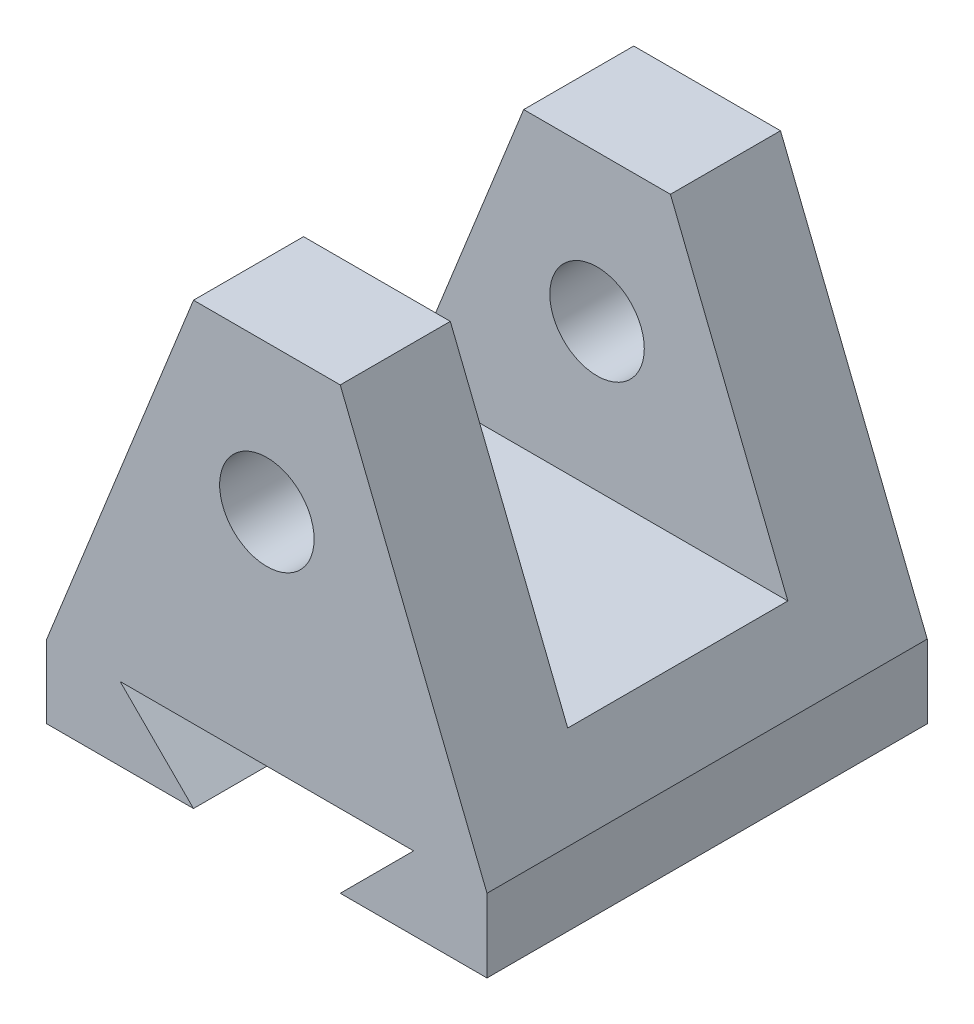
ISO-10303-21;
HEADER;
FILE_DESCRIPTION(('STEP AP214'),'2;1');
FILE_NAME('part.step','',(''),(''),'','','');
FILE_SCHEMA(('AUTOMOTIVE_DESIGN { 1 0 10303 214 1 1 1 1 }'));
ENDSEC;
DATA;
#1=APPLICATION_CONTEXT('core data for automotive mechanical design processes');
#2=APPLICATION_PROTOCOL_DEFINITION('international standard','automotive_design',2000,#1);
#3=PRODUCT_CONTEXT('',#1,'mechanical');
#4=PRODUCT('Part','Part','',(#3));
#5=PRODUCT_RELATED_PRODUCT_CATEGORY('part','',(#4));
#6=PRODUCT_DEFINITION_FORMATION('','',#4);
#7=PRODUCT_DEFINITION_CONTEXT('part definition',#1,'design');
#8=PRODUCT_DEFINITION('design','',#6,#7);
#9=PRODUCT_DEFINITION_SHAPE('','',#8);
#10=(LENGTH_UNIT() NAMED_UNIT(*) SI_UNIT(.MILLI.,.METRE.));
#11=(NAMED_UNIT(*) PLANE_ANGLE_UNIT() SI_UNIT($,.RADIAN.));
#12=(NAMED_UNIT(*) SI_UNIT($,.STERADIAN.) SOLID_ANGLE_UNIT());
#13=UNCERTAINTY_MEASURE_WITH_UNIT(LENGTH_MEASURE(1.E-05),#10,'distance_accuracy_value','');
#14=(GEOMETRIC_REPRESENTATION_CONTEXT(3) GLOBAL_UNCERTAINTY_ASSIGNED_CONTEXT((#13)) GLOBAL_UNIT_ASSIGNED_CONTEXT((#10,
#11,#12)) REPRESENTATION_CONTEXT('',''));
#15=CARTESIAN_POINT('',(0.,0.,0.));
#16=DIRECTION('',(0.,0.,1.));
#17=DIRECTION('',(1.,0.,0.));
#18=AXIS2_PLACEMENT_3D('',#15,#16,#17);
#19=CARTESIAN_POINT('',(-10.,50.,60.));
#20=DIRECTION('',(0.,-1.,0.));
#21=DIRECTION('',(0.,0.,-1.));
#22=AXIS2_PLACEMENT_3D('',#19,#20,#21);
#23=PLANE('',#22);
#24=DIRECTION('',(0.,0.,-1.));
#25=VECTOR('',#24,1.);
#26=CARTESIAN_POINT('',(-10.,50.,60.));
#27=LINE('',#26,#25);
#28=CARTESIAN_POINT('',(-10.,50.,15.));
#29=VERTEX_POINT('',#28);
#30=CARTESIAN_POINT('',(-10.,50.,0.));
#31=VERTEX_POINT('',#30);
#32=EDGE_CURVE('E157',#29,#31,#27,.T.);
#33=ORIENTED_EDGE('',*,*,#32,.F.);
#34=DIRECTION('',(1.,0.,0.));
#35=VECTOR('',#34,1.);
#36=CARTESIAN_POINT('',(-30.,50.,15.));
#37=LINE('',#36,#35);
#38=CARTESIAN_POINT('',(9.99999999999999,50.,15.));
#39=VERTEX_POINT('',#38);
#40=EDGE_CURVE('E235',#29,#39,#37,.T.);
#41=ORIENTED_EDGE('',*,*,#40,.T.);
#42=DIRECTION('',(0.,0.,-1.));
#43=VECTOR('',#42,1.);
#44=CARTESIAN_POINT('',(10.,50.,60.));
#45=LINE('',#44,#43);
#46=CARTESIAN_POINT('',(10.,50.,0.));
#47=VERTEX_POINT('',#46);
#48=EDGE_CURVE('E156',#39,#47,#45,.T.);
#49=ORIENTED_EDGE('',*,*,#48,.T.);
#50=DIRECTION('',(-1.,0.,0.));
#51=VECTOR('',#50,1.);
#52=CARTESIAN_POINT('',(-10.,50.,0.));
#53=LINE('',#52,#51);
#54=EDGE_CURVE('E192',#47,#31,#53,.T.);
#55=ORIENTED_EDGE('',*,*,#54,.T.);
#56=EDGE_LOOP('',(#33,#41,#49,#55));
#57=FACE_BOUND('',#56,.T.);
#58=ADVANCED_FACE('F39',(#57),#23,.F.);
#59=CARTESIAN_POINT('',(0.,30.,0.));
#60=DIRECTION('',(0.,0.,1.));
#61=DIRECTION('',(1.,0.,0.));
#62=AXIS2_PLACEMENT_3D('',#59,#60,#61);
#63=CYLINDRICAL_SURFACE('',#62,6.43622338518392);
#64=CARTESIAN_POINT('',(0.,30.,15.));
#65=DIRECTION('',(0.,0.,-1.));
#66=DIRECTION('',(-1.,0.,0.));
#67=AXIS2_PLACEMENT_3D('',#64,#65,#66);
#68=CIRCLE('',#67,6.43622338518392);
#69=CARTESIAN_POINT('',(-6.43622338518392,30.,15.));
#70=VERTEX_POINT('',#69);
#71=EDGE_CURVE('E236',#70,#70,#68,.F.);
#72=ORIENTED_EDGE('',*,*,#71,.T.);
#73=EDGE_LOOP('',(#72));
#74=FACE_BOUND('',#73,.T.);
#75=CARTESIAN_POINT('',(0.,30.,0.));
#76=DIRECTION('',(0.,0.,1.));
#77=DIRECTION('',(1.,0.,0.));
#78=AXIS2_PLACEMENT_3D('',#75,#76,#77);
#79=CIRCLE('',#78,6.43622338518392);
#80=CARTESIAN_POINT('',(6.43622338518392,30.,0.));
#81=VERTEX_POINT('',#80);
#82=EDGE_CURVE('E173',#81,#81,#79,.T.);
#83=ORIENTED_EDGE('',*,*,#82,.F.);
#84=EDGE_LOOP('',(#83));
#85=FACE_BOUND('',#84,.T.);
#86=ADVANCED_FACE('F342',(#74,#85),#63,.F.);
#87=CARTESIAN_POINT('',(-10.,-10.,60.));
#88=DIRECTION('',(0.,1.,0.));
#89=DIRECTION('',(-1.,0.,0.));
#90=AXIS2_PLACEMENT_3D('',#87,#88,#89);
#91=PLANE('',#90);
#92=DIRECTION('',(1.,0.,0.));
#93=VECTOR('',#92,1.);
#94=CARTESIAN_POINT('',(-10.,-10.,0.));
#95=LINE('',#94,#93);
#96=CARTESIAN_POINT('',(-30.,-10.,0.));
#97=VERTEX_POINT('',#96);
#98=CARTESIAN_POINT('',(-10.,-10.,0.));
#99=VERTEX_POINT('',#98);
#100=EDGE_CURVE('E168',#97,#99,#95,.T.);
#101=ORIENTED_EDGE('',*,*,#100,.T.);
#102=DIRECTION('',(0.,0.,-1.));
#103=VECTOR('',#102,1.);
#104=CARTESIAN_POINT('',(-10.,-10.,60.));
#105=LINE('',#104,#103);
#106=CARTESIAN_POINT('',(-10.,-10.,60.));
#107=VERTEX_POINT('',#106);
#108=EDGE_CURVE('E48',#107,#99,#105,.T.);
#109=ORIENTED_EDGE('',*,*,#108,.F.);
#110=DIRECTION('',(1.,0.,0.));
#111=VECTOR('',#110,1.);
#112=CARTESIAN_POINT('',(-10.,-10.,60.));
#113=LINE('',#112,#111);
#114=CARTESIAN_POINT('',(-30.,-10.,60.));
#115=VERTEX_POINT('',#114);
#116=EDGE_CURVE('E201',#115,#107,#113,.T.);
#117=ORIENTED_EDGE('',*,*,#116,.F.);
#118=DIRECTION('',(0.,0.,-1.));
#119=VECTOR('',#118,1.);
#120=CARTESIAN_POINT('',(-30.,-10.,60.));
#121=LINE('',#120,#119);
#122=EDGE_CURVE('E164',#115,#97,#121,.T.);
#123=ORIENTED_EDGE('',*,*,#122,.T.);
#124=EDGE_LOOP('',(#101,#109,#117,#123));
#125=FACE_BOUND('',#124,.T.);
#126=ADVANCED_FACE('F41',(#125),#91,.F.);
#127=CARTESIAN_POINT('',(-20.0000000000001,0.,60.));
#128=DIRECTION('',(-0.707106781186544,-0.707106781186551,0.));
#129=DIRECTION('',(0.707106781186551,-0.707106781186544,0.));
#130=AXIS2_PLACEMENT_3D('',#127,#128,#129);
#131=PLANE('',#130);
#132=DIRECTION('',(-0.707106781186551,0.707106781186543,0.));
#133=VECTOR('',#132,1.);
#134=CARTESIAN_POINT('',(-20.0000000000001,0.,0.));
#135=LINE('',#134,#133);
#136=CARTESIAN_POINT('',(-20.0000000000001,0.,0.));
#137=VERTEX_POINT('',#136);
#138=EDGE_CURVE('E172',#99,#137,#135,.T.);
#139=ORIENTED_EDGE('',*,*,#138,.T.);
#140=DIRECTION('',(0.,0.,-1.));
#141=VECTOR('',#140,1.);
#142=CARTESIAN_POINT('',(-20.0000000000001,0.,60.));
#143=LINE('',#142,#141);
#144=CARTESIAN_POINT('',(-20.0000000000001,0.,60.));
#145=VERTEX_POINT('',#144);
#146=EDGE_CURVE('E225',#145,#137,#143,.T.);
#147=ORIENTED_EDGE('',*,*,#146,.F.);
#148=DIRECTION('',(-0.707106781186551,0.707106781186543,0.));
#149=VECTOR('',#148,1.);
#150=CARTESIAN_POINT('',(-20.0000000000001,0.,60.));
#151=LINE('',#150,#149);
#152=EDGE_CURVE('E112',#107,#145,#151,.T.);
#153=ORIENTED_EDGE('',*,*,#152,.F.);
#154=ORIENTED_EDGE('',*,*,#108,.T.);
#155=EDGE_LOOP('',(#139,#147,#153,#154));
#156=FACE_BOUND('',#155,.T.);
#157=ADVANCED_FACE('F369',(#156),#131,.F.);
#158=CARTESIAN_POINT('',(20.0000000000001,0.,60.));
#159=DIRECTION('',(0.,1.,0.));
#160=DIRECTION('',(-1.,0.,0.));
#161=AXIS2_PLACEMENT_3D('',#158,#159,#160);
#162=PLANE('',#161);
#163=DIRECTION('',(1.,0.,0.));
#164=VECTOR('',#163,1.);
#165=CARTESIAN_POINT('',(20.0000000000001,0.,0.));
#166=LINE('',#165,#164);
#167=CARTESIAN_POINT('',(20.0000000000001,0.,0.));
#168=VERTEX_POINT('',#167);
#169=EDGE_CURVE('E176',#137,#168,#166,.T.);
#170=ORIENTED_EDGE('',*,*,#169,.T.);
#171=DIRECTION('',(0.,0.,-1.));
#172=VECTOR('',#171,1.);
#173=CARTESIAN_POINT('',(20.0000000000001,0.,60.));
#174=LINE('',#173,#172);
#175=CARTESIAN_POINT('',(20.0000000000001,0.,60.));
#176=VERTEX_POINT('',#175);
#177=EDGE_CURVE('E221',#176,#168,#174,.T.);
#178=ORIENTED_EDGE('',*,*,#177,.F.);
#179=DIRECTION('',(1.,0.,0.));
#180=VECTOR('',#179,1.);
#181=CARTESIAN_POINT('',(20.0000000000001,0.,60.));
#182=LINE('',#181,#180);
#183=EDGE_CURVE('E274',#145,#176,#182,.T.);
#184=ORIENTED_EDGE('',*,*,#183,.F.);
#185=ORIENTED_EDGE('',*,*,#146,.T.);
#186=EDGE_LOOP('',(#170,#178,#184,#185));
#187=FACE_BOUND('',#186,.T.);
#188=ADVANCED_FACE('F366',(#187),#162,.F.);
#189=CARTESIAN_POINT('',(10.,-10.,60.));
#190=DIRECTION('',(0.707106781186543,-0.707106781186552,0.));
#191=DIRECTION('',(0.707106781186552,0.707106781186543,0.));
#192=AXIS2_PLACEMENT_3D('',#189,#190,#191);
#193=PLANE('',#192);
#194=DIRECTION('',(-0.707106781186552,-0.707106781186543,0.));
#195=VECTOR('',#194,1.);
#196=CARTESIAN_POINT('',(10.,-10.,0.));
#197=LINE('',#196,#195);
#198=CARTESIAN_POINT('',(10.,-10.,0.));
#199=VERTEX_POINT('',#198);
#200=EDGE_CURVE('E179',#168,#199,#197,.T.);
#201=ORIENTED_EDGE('',*,*,#200,.T.);
#202=DIRECTION('',(0.,0.,-1.));
#203=VECTOR('',#202,1.);
#204=CARTESIAN_POINT('',(10.,-10.,60.));
#205=LINE('',#204,#203);
#206=CARTESIAN_POINT('',(10.,-10.,60.));
#207=VERTEX_POINT('',#206);
#208=EDGE_CURVE('E217',#207,#199,#205,.T.);
#209=ORIENTED_EDGE('',*,*,#208,.F.);
#210=DIRECTION('',(-0.707106781186552,-0.707106781186543,0.));
#211=VECTOR('',#210,1.);
#212=CARTESIAN_POINT('',(10.,-10.,60.));
#213=LINE('',#212,#211);
#214=EDGE_CURVE('E277',#176,#207,#213,.T.);
#215=ORIENTED_EDGE('',*,*,#214,.F.);
#216=ORIENTED_EDGE('',*,*,#177,.T.);
#217=EDGE_LOOP('',(#201,#209,#215,#216));
#218=FACE_BOUND('',#217,.T.);
#219=ADVANCED_FACE('F362',(#218),#193,.F.);
#220=CARTESIAN_POINT('',(30.,-10.,60.));
#221=DIRECTION('',(0.,1.,0.));
#222=DIRECTION('',(0.,0.,1.));
#223=AXIS2_PLACEMENT_3D('',#220,#221,#222);
#224=PLANE('',#223);
#225=DIRECTION('',(1.,0.,0.));
#226=VECTOR('',#225,1.);
#227=CARTESIAN_POINT('',(30.,-10.,0.));
#228=LINE('',#227,#226);
#229=CARTESIAN_POINT('',(30.,-10.,0.));
#230=VERTEX_POINT('',#229);
#231=EDGE_CURVE('E182',#199,#230,#228,.T.);
#232=ORIENTED_EDGE('',*,*,#231,.T.);
#233=DIRECTION('',(0.,0.,-1.));
#234=VECTOR('',#233,1.);
#235=CARTESIAN_POINT('',(30.,-10.,60.));
#236=LINE('',#235,#234);
#237=CARTESIAN_POINT('',(30.,-10.,60.));
#238=VERTEX_POINT('',#237);
#239=EDGE_CURVE('E213',#238,#230,#236,.T.);
#240=ORIENTED_EDGE('',*,*,#239,.F.);
#241=DIRECTION('',(1.,0.,0.));
#242=VECTOR('',#241,1.);
#243=CARTESIAN_POINT('',(30.,-10.,60.));
#244=LINE('',#243,#242);
#245=EDGE_CURVE('E280',#207,#238,#244,.T.);
#246=ORIENTED_EDGE('',*,*,#245,.F.);
#247=ORIENTED_EDGE('',*,*,#208,.T.);
#248=EDGE_LOOP('',(#232,#240,#246,#247));
#249=FACE_BOUND('',#248,.T.);
#250=ADVANCED_FACE('F357',(#249),#224,.F.);
#251=CARTESIAN_POINT('',(30.,0.,60.));
#252=DIRECTION('',(-1.,0.,0.));
#253=DIRECTION('',(0.,0.,1.));
#254=AXIS2_PLACEMENT_3D('',#251,#252,#253);
#255=PLANE('',#254);
#256=DIRECTION('',(0.,1.,0.));
#257=VECTOR('',#256,1.);
#258=CARTESIAN_POINT('',(30.,0.,0.));
#259=LINE('',#258,#257);
#260=CARTESIAN_POINT('',(30.,0.,0.));
#261=VERTEX_POINT('',#260);
#262=EDGE_CURVE('E185',#230,#261,#259,.T.);
#263=ORIENTED_EDGE('',*,*,#262,.T.);
#264=DIRECTION('',(0.,0.,-1.));
#265=VECTOR('',#264,1.);
#266=CARTESIAN_POINT('',(30.,0.,60.));
#267=LINE('',#266,#265);
#268=CARTESIAN_POINT('',(30.,0.,60.));
#269=VERTEX_POINT('',#268);
#270=EDGE_CURVE('E209',#269,#261,#267,.T.);
#271=ORIENTED_EDGE('',*,*,#270,.F.);
#272=DIRECTION('',(0.,1.,0.));
#273=VECTOR('',#272,1.);
#274=CARTESIAN_POINT('',(30.,0.,60.));
#275=LINE('',#274,#273);
#276=EDGE_CURVE('E283',#238,#269,#275,.T.);
#277=ORIENTED_EDGE('',*,*,#276,.F.);
#278=ORIENTED_EDGE('',*,*,#239,.T.);
#279=EDGE_LOOP('',(#263,#271,#277,#278));
#280=FACE_BOUND('',#279,.T.);
#281=ADVANCED_FACE('F291',(#280),#255,.F.);
#282=CARTESIAN_POINT('',(10.,50.,60.));
#283=DIRECTION('',(-0.928476690885259,-0.371390676354104,0.));
#284=DIRECTION('',(0.371390676354104,-0.928476690885259,0.));
#285=AXIS2_PLACEMENT_3D('',#282,#283,#284);
#286=PLANE('',#285);
#287=ORIENTED_EDGE('',*,*,#48,.F.);
#288=DIRECTION('',(0.371390676354104,-0.928476690885259,0.));
#289=VECTOR('',#288,1.);
#290=CARTESIAN_POINT('',(10.,50.,15.));
#291=LINE('',#290,#289);
#292=CARTESIAN_POINT('',(26.,10.,15.));
#293=VERTEX_POINT('',#292);
#294=EDGE_CURVE('E246',#39,#293,#291,.T.);
#295=ORIENTED_EDGE('',*,*,#294,.T.);
#296=DIRECTION('',(0.,0.,1.));
#297=VECTOR('',#296,1.);
#298=CARTESIAN_POINT('',(26.,9.99999999999999,60.));
#299=LINE('',#298,#297);
#300=CARTESIAN_POINT('',(26.,9.99999999999999,45.));
#301=VERTEX_POINT('',#300);
#302=EDGE_CURVE('E260',#293,#301,#299,.T.);
#303=ORIENTED_EDGE('',*,*,#302,.T.);
#304=DIRECTION('',(-0.371390676354104,0.928476690885259,0.));
#305=VECTOR('',#304,1.);
#306=CARTESIAN_POINT('',(10.,50.,45.));
#307=LINE('',#306,#305);
#308=CARTESIAN_POINT('',(9.99999999999999,50.,45.));
#309=VERTEX_POINT('',#308);
#310=EDGE_CURVE('E240',#301,#309,#307,.T.);
#311=ORIENTED_EDGE('',*,*,#310,.T.);
#312=CARTESIAN_POINT('',(10.,50.,60.));
#313=VERTEX_POINT('',#312);
#314=EDGE_CURVE('E206',#313,#309,#45,.T.);
#315=ORIENTED_EDGE('',*,*,#314,.F.);
#316=DIRECTION('',(-0.371390676354104,0.928476690885259,0.));
#317=VECTOR('',#316,1.);
#318=CARTESIAN_POINT('',(10.,50.,60.));
#319=LINE('',#318,#317);
#320=EDGE_CURVE('E140',#269,#313,#319,.T.);
#321=ORIENTED_EDGE('',*,*,#320,.F.);
#322=ORIENTED_EDGE('',*,*,#270,.T.);
#323=DIRECTION('',(-0.371390676354104,0.928476690885259,0.));
#324=VECTOR('',#323,1.);
#325=CARTESIAN_POINT('',(10.,50.,0.));
#326=LINE('',#325,#324);
#327=EDGE_CURVE('E188',#261,#47,#326,.T.);
#328=ORIENTED_EDGE('',*,*,#327,.T.);
#329=EDGE_LOOP('',(#287,#295,#303,#311,#315,#321,#322,#328));
#330=FACE_BOUND('',#329,.T.);
#331=ADVANCED_FACE('F295',(#330),#286,.F.);
#332=ORIENTED_EDGE('',*,*,#314,.T.);
#333=DIRECTION('',(1.,0.,0.));
#334=VECTOR('',#333,1.);
#335=CARTESIAN_POINT('',(-30.,50.,45.));
#336=LINE('',#335,#334);
#337=CARTESIAN_POINT('',(-10.,50.,45.));
#338=VERTEX_POINT('',#337);
#339=EDGE_CURVE('E152',#338,#309,#336,.T.);
#340=ORIENTED_EDGE('',*,*,#339,.F.);
#341=CARTESIAN_POINT('',(-10.,50.,60.));
#342=VERTEX_POINT('',#341);
#343=EDGE_CURVE('E148',#342,#338,#27,.T.);
#344=ORIENTED_EDGE('',*,*,#343,.F.);
#345=DIRECTION('',(-1.,0.,0.));
#346=VECTOR('',#345,1.);
#347=CARTESIAN_POINT('',(-10.,50.,60.));
#348=LINE('',#347,#346);
#349=EDGE_CURVE('E133',#313,#342,#348,.T.);
#350=ORIENTED_EDGE('',*,*,#349,.F.);
#351=EDGE_LOOP('',(#332,#340,#344,#350));
#352=FACE_BOUND('',#351,.T.);
#353=ADVANCED_FACE('F149',(#352),#23,.F.);
#354=CARTESIAN_POINT('',(-30.,0.,60.));
#355=DIRECTION('',(0.928476690885259,-0.371390676354104,0.));
#356=DIRECTION('',(0.371390676354104,0.928476690885259,0.));
#357=AXIS2_PLACEMENT_3D('',#354,#355,#356);
#358=PLANE('',#357);
#359=DIRECTION('',(0.,0.,-1.));
#360=VECTOR('',#359,1.);
#361=CARTESIAN_POINT('',(-26.,10.,60.));
#362=LINE('',#361,#360);
#363=CARTESIAN_POINT('',(-26.,10.,45.));
#364=VERTEX_POINT('',#363);
#365=CARTESIAN_POINT('',(-26.,10.,15.));
#366=VERTEX_POINT('',#365);
#367=EDGE_CURVE('E11',#364,#366,#362,.T.);
#368=ORIENTED_EDGE('',*,*,#367,.T.);
#369=DIRECTION('',(0.371390676354104,0.928476690885259,0.));
#370=VECTOR('',#369,1.);
#371=CARTESIAN_POINT('',(-30.,0.,15.));
#372=LINE('',#371,#370);
#373=EDGE_CURVE('E239',#366,#29,#372,.T.);
#374=ORIENTED_EDGE('',*,*,#373,.T.);
#375=ORIENTED_EDGE('',*,*,#32,.T.);
#376=DIRECTION('',(-0.371390676354104,-0.928476690885259,0.));
#377=VECTOR('',#376,1.);
#378=CARTESIAN_POINT('',(-30.,0.,0.));
#379=LINE('',#378,#377);
#380=CARTESIAN_POINT('',(-30.,0.,0.));
#381=VERTEX_POINT('',#380);
#382=EDGE_CURVE('E196',#31,#381,#379,.T.);
#383=ORIENTED_EDGE('',*,*,#382,.T.);
#384=DIRECTION('',(0.,0.,-1.));
#385=VECTOR('',#384,1.);
#386=CARTESIAN_POINT('',(-30.,0.,60.));
#387=LINE('',#386,#385);
#388=CARTESIAN_POINT('',(-30.,0.,60.));
#389=VERTEX_POINT('',#388);
#390=EDGE_CURVE('E160',#389,#381,#387,.T.);
#391=ORIENTED_EDGE('',*,*,#390,.F.);
#392=DIRECTION('',(-0.371390676354104,-0.928476690885259,0.));
#393=VECTOR('',#392,1.);
#394=CARTESIAN_POINT('',(-30.,0.,60.));
#395=LINE('',#394,#393);
#396=EDGE_CURVE('E137',#342,#389,#395,.T.);
#397=ORIENTED_EDGE('',*,*,#396,.F.);
#398=ORIENTED_EDGE('',*,*,#343,.T.);
#399=DIRECTION('',(-0.371390676354104,-0.928476690885259,0.));
#400=VECTOR('',#399,1.);
#401=CARTESIAN_POINT('',(-30.,0.,45.));
#402=LINE('',#401,#400);
#403=EDGE_CURVE('E234',#338,#364,#402,.T.);
#404=ORIENTED_EDGE('',*,*,#403,.T.);
#405=EDGE_LOOP('',(#368,#374,#375,#383,#391,#397,#398,#404));
#406=FACE_BOUND('',#405,.T.);
#407=ADVANCED_FACE('F159',(#406),#358,.F.);
#408=CARTESIAN_POINT('',(-30.,-10.,60.));
#409=DIRECTION('',(1.,0.,0.));
#410=DIRECTION('',(0.,0.,-1.));
#411=AXIS2_PLACEMENT_3D('',#408,#409,#410);
#412=PLANE('',#411);
#413=DIRECTION('',(0.,-1.,0.));
#414=VECTOR('',#413,1.);
#415=CARTESIAN_POINT('',(-30.,-10.,0.));
#416=LINE('',#415,#414);
#417=EDGE_CURVE('E103',#381,#97,#416,.T.);
#418=ORIENTED_EDGE('',*,*,#417,.T.);
#419=ORIENTED_EDGE('',*,*,#122,.F.);
#420=DIRECTION('',(0.,-1.,0.));
#421=VECTOR('',#420,1.);
#422=CARTESIAN_POINT('',(-30.,-10.,60.));
#423=LINE('',#422,#421);
#424=EDGE_CURVE('E64',#389,#115,#423,.T.);
#425=ORIENTED_EDGE('',*,*,#424,.F.);
#426=ORIENTED_EDGE('',*,*,#390,.T.);
#427=EDGE_LOOP('',(#418,#419,#425,#426));
#428=FACE_BOUND('',#427,.T.);
#429=ADVANCED_FACE('F330',(#428),#412,.F.);
#430=CARTESIAN_POINT('',(0.,0.,60.));
#431=DIRECTION('',(0.,0.,-1.));
#432=DIRECTION('',(-1.,0.,0.));
#433=AXIS2_PLACEMENT_3D('',#430,#431,#432);
#434=PLANE('',#433);
#435=CARTESIAN_POINT('',(0.,30.,60.));
#436=DIRECTION('',(0.,0.,1.));
#437=DIRECTION('',(1.,0.,0.));
#438=AXIS2_PLACEMENT_3D('',#435,#436,#437);
#439=CIRCLE('',#438,6.43622338518392);
#440=CARTESIAN_POINT('',(6.43622338518392,30.,60.));
#441=VERTEX_POINT('',#440);
#442=EDGE_CURVE('E263',#441,#441,#439,.T.);
#443=ORIENTED_EDGE('',*,*,#442,.F.);
#444=EDGE_LOOP('',(#443));
#445=FACE_BOUND('',#444,.T.);
#446=ORIENTED_EDGE('',*,*,#116,.T.);
#447=ORIENTED_EDGE('',*,*,#152,.T.);
#448=ORIENTED_EDGE('',*,*,#183,.T.);
#449=ORIENTED_EDGE('',*,*,#214,.T.);
#450=ORIENTED_EDGE('',*,*,#245,.T.);
#451=ORIENTED_EDGE('',*,*,#276,.T.);
#452=ORIENTED_EDGE('',*,*,#320,.T.);
#453=ORIENTED_EDGE('',*,*,#349,.T.);
#454=ORIENTED_EDGE('',*,*,#396,.T.);
#455=ORIENTED_EDGE('',*,*,#424,.T.);
#456=EDGE_LOOP('',(#446,#447,#448,#449,#450,#451,#452,#453,#454,#455));
#457=FACE_BOUND('',#456,.T.);
#458=ADVANCED_FACE('F135',(#445,#457),#434,.F.);
#459=CARTESIAN_POINT('',(0.,0.,0.));
#460=DIRECTION('',(0.,0.,-1.));
#461=DIRECTION('',(-1.,0.,0.));
#462=AXIS2_PLACEMENT_3D('',#459,#460,#461);
#463=PLANE('',#462);
#464=ORIENTED_EDGE('',*,*,#82,.T.);
#465=EDGE_LOOP('',(#464));
#466=FACE_BOUND('',#465,.T.);
#467=ORIENTED_EDGE('',*,*,#100,.F.);
#468=ORIENTED_EDGE('',*,*,#417,.F.);
#469=ORIENTED_EDGE('',*,*,#382,.F.);
#470=ORIENTED_EDGE('',*,*,#54,.F.);
#471=ORIENTED_EDGE('',*,*,#327,.F.);
#472=ORIENTED_EDGE('',*,*,#262,.F.);
#473=ORIENTED_EDGE('',*,*,#231,.F.);
#474=ORIENTED_EDGE('',*,*,#200,.F.);
#475=ORIENTED_EDGE('',*,*,#169,.F.);
#476=ORIENTED_EDGE('',*,*,#138,.F.);
#477=EDGE_LOOP('',(#467,#468,#469,#470,#471,#472,#473,#474,#475,#476));
#478=FACE_BOUND('',#477,.T.);
#479=ADVANCED_FACE('F325',(#466,#478),#463,.T.);
#480=CARTESIAN_POINT('',(0.,30.,45.));
#481=DIRECTION('',(0.,0.,1.));
#482=DIRECTION('',(0.,-1.,0.));
#483=AXIS2_PLACEMENT_3D('',#480,#481,#482);
#484=CIRCLE('',#483,6.43622338518392);
#485=CARTESIAN_POINT('',(0.,23.5637766148161,45.));
#486=VERTEX_POINT('',#485);
#487=EDGE_CURVE('E231',#486,#486,#484,.F.);
#488=ORIENTED_EDGE('',*,*,#487,.T.);
#489=EDGE_LOOP('',(#488));
#490=FACE_BOUND('',#489,.T.);
#491=ORIENTED_EDGE('',*,*,#442,.T.);
#492=EDGE_LOOP('',(#491));
#493=FACE_BOUND('',#492,.T.);
#494=ADVANCED_FACE('F348',(#490,#493),#63,.F.);
#495=CARTESIAN_POINT('',(-30.,10.,45.));
#496=DIRECTION('',(0.,-1.,0.));
#497=DIRECTION('',(0.,0.,-1.));
#498=AXIS2_PLACEMENT_3D('',#495,#496,#497);
#499=PLANE('',#498);
#500=DIRECTION('',(1.,0.,0.));
#501=VECTOR('',#500,1.);
#502=CARTESIAN_POINT('',(-30.,10.,15.));
#503=LINE('',#502,#501);
#504=EDGE_CURVE('E314',#366,#293,#503,.T.);
#505=ORIENTED_EDGE('',*,*,#504,.F.);
#506=ORIENTED_EDGE('',*,*,#367,.F.);
#507=DIRECTION('',(1.,0.,0.));
#508=VECTOR('',#507,1.);
#509=CARTESIAN_POINT('',(-30.,10.,45.));
#510=LINE('',#509,#508);
#511=EDGE_CURVE('E55',#364,#301,#510,.T.);
#512=ORIENTED_EDGE('',*,*,#511,.T.);
#513=ORIENTED_EDGE('',*,*,#302,.F.);
#514=EDGE_LOOP('',(#505,#506,#512,#513));
#515=FACE_BOUND('',#514,.T.);
#516=ADVANCED_FACE('F415',(#515),#499,.F.);
#517=CARTESIAN_POINT('',(-30.,10.,15.));
#518=DIRECTION('',(0.,0.,-1.));
#519=DIRECTION('',(-1.,0.,0.));
#520=AXIS2_PLACEMENT_3D('',#517,#518,#519);
#521=PLANE('',#520);
#522=ORIENTED_EDGE('',*,*,#71,.F.);
#523=EDGE_LOOP('',(#522));
#524=FACE_BOUND('',#523,.T.);
#525=ORIENTED_EDGE('',*,*,#40,.F.);
#526=ORIENTED_EDGE('',*,*,#373,.F.);
#527=ORIENTED_EDGE('',*,*,#504,.T.);
#528=ORIENTED_EDGE('',*,*,#294,.F.);
#529=EDGE_LOOP('',(#525,#526,#527,#528));
#530=FACE_BOUND('',#529,.T.);
#531=ADVANCED_FACE('F312',(#524,#530),#521,.F.);
#532=CARTESIAN_POINT('',(-30.,50.,45.));
#533=DIRECTION('',(0.,0.,1.));
#534=DIRECTION('',(0.,-1.,0.));
#535=AXIS2_PLACEMENT_3D('',#532,#533,#534);
#536=PLANE('',#535);
#537=ORIENTED_EDGE('',*,*,#487,.F.);
#538=EDGE_LOOP('',(#537));
#539=FACE_BOUND('',#538,.T.);
#540=ORIENTED_EDGE('',*,*,#511,.F.);
#541=ORIENTED_EDGE('',*,*,#403,.F.);
#542=ORIENTED_EDGE('',*,*,#339,.T.);
#543=ORIENTED_EDGE('',*,*,#310,.F.);
#544=EDGE_LOOP('',(#540,#541,#542,#543));
#545=FACE_BOUND('',#544,.T.);
#546=ADVANCED_FACE('F435',(#539,#545),#536,.F.);
#547=CLOSED_SHELL('',(#58,#86,#126,#157,#188,#219,#250,#281,#331,#353,#407,#429,#458,#479,#494,
#516,#531,#546));
#548=MANIFOLD_SOLID_BREP('B2',#547);
#549=ADVANCED_BREP_SHAPE_REPRESENTATION('',(#18,#548),#14);
#550=SHAPE_DEFINITION_REPRESENTATION(#9,#549);
ENDSEC;
END-ISO-10303-21;
